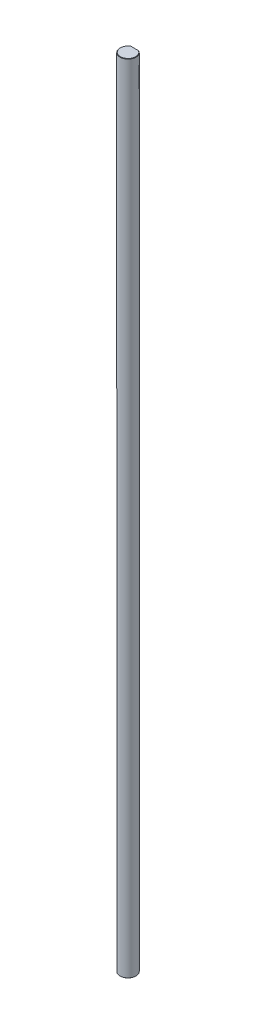
ISO-10303-21;
HEADER;
FILE_DESCRIPTION(('STEP AP214'),'2;1');
FILE_NAME('part.step','',(''),(''),'','','');
FILE_SCHEMA(('AUTOMOTIVE_DESIGN { 1 0 10303 214 1 1 1 1 }'));
ENDSEC;
DATA;
#1=APPLICATION_CONTEXT('core data for automotive mechanical design processes');
#2=APPLICATION_PROTOCOL_DEFINITION('international standard','automotive_design',2000,#1);
#3=PRODUCT_CONTEXT('',#1,'mechanical');
#4=PRODUCT('Part','Part','',(#3));
#5=PRODUCT_RELATED_PRODUCT_CATEGORY('part','',(#4));
#6=PRODUCT_DEFINITION_FORMATION('','',#4);
#7=PRODUCT_DEFINITION_CONTEXT('part definition',#1,'design');
#8=PRODUCT_DEFINITION('design','',#6,#7);
#9=PRODUCT_DEFINITION_SHAPE('','',#8);
#10=(LENGTH_UNIT() NAMED_UNIT(*) SI_UNIT(.MILLI.,.METRE.));
#11=(NAMED_UNIT(*) PLANE_ANGLE_UNIT() SI_UNIT($,.RADIAN.));
#12=(NAMED_UNIT(*) SI_UNIT($,.STERADIAN.) SOLID_ANGLE_UNIT());
#13=UNCERTAINTY_MEASURE_WITH_UNIT(LENGTH_MEASURE(1.E-05),#10,'distance_accuracy_value','');
#14=(GEOMETRIC_REPRESENTATION_CONTEXT(3) GLOBAL_UNCERTAINTY_ASSIGNED_CONTEXT((#13)) GLOBAL_UNIT_ASSIGNED_CONTEXT((#10,
#11,#12)) REPRESENTATION_CONTEXT('',''));
#15=CARTESIAN_POINT('',(0.,0.,0.));
#16=DIRECTION('',(0.,0.,1.));
#17=DIRECTION('',(1.,0.,0.));
#18=AXIS2_PLACEMENT_3D('',#15,#16,#17);
#19=CARTESIAN_POINT('',(0.,300.,0.));
#20=DIRECTION('',(0.,-1.,0.));
#21=DIRECTION('',(0.,0.,-1.));
#22=AXIS2_PLACEMENT_3D('',#19,#20,#21);
#23=CONICAL_SURFACE('',#22,2.875,0.78539816339744);
#24=CARTESIAN_POINT('',(-1.6583123951777,299.875,-2.5));
#25=CARTESIAN_POINT('',(-1.57973572193477,299.918434890403,-2.5));
#26=CARTESIAN_POINT('',(-1.50022900034243,299.960246696464,-2.5));
#27=CARTESIAN_POINT('',(-1.4197270864501,300.,-2.5));
#28=(BOUNDED_CURVE() B_SPLINE_CURVE(3,(#24,#25,#26,#27),.UNSPECIFIED.,.F.,
.F.) B_SPLINE_CURVE_WITH_KNOTS((4,4),(0.,0.000269347265701059),
.UNSPECIFIED.) CURVE() GEOMETRIC_REPRESENTATION_ITEM() RATIONAL_B_SPLINE_CURVE((1.,1.,1.,1.)) REPRESENTATION_ITEM(''));
#29=CARTESIAN_POINT('',(-1.6583123951777,299.875,-2.5));
#30=VERTEX_POINT('',#29);
#31=CARTESIAN_POINT('',(-1.4197270864501,300.,-2.5));
#32=VERTEX_POINT('',#31);
#33=EDGE_CURVE('E82',#30,#32,#28,.T.);
#34=ORIENTED_EDGE('',*,*,#33,.F.);
#35=CARTESIAN_POINT('',(0.,299.875,0.));
#36=DIRECTION('',(0.,-1.,0.));
#37=DIRECTION('',(0.,0.,1.));
#38=AXIS2_PLACEMENT_3D('',#35,#36,#37);
#39=CIRCLE('',#38,3.);
#40=CARTESIAN_POINT('',(1.6583123951777,299.875,-2.5));
#41=VERTEX_POINT('',#40);
#42=EDGE_CURVE('E104',#41,#30,#39,.T.);
#43=ORIENTED_EDGE('',*,*,#42,.F.);
#44=CARTESIAN_POINT('',(1.4197270864501,300.,-2.5));
#45=CARTESIAN_POINT('',(1.50022900034241,299.960246696464,-2.5));
#46=CARTESIAN_POINT('',(1.57973572193477,299.918434890403,-2.5));
#47=CARTESIAN_POINT('',(1.6583123951777,299.875,-2.5));
#48=(BOUNDED_CURVE() B_SPLINE_CURVE(3,(#44,#45,#46,#47),.UNSPECIFIED.,.F.,
.F.) B_SPLINE_CURVE_WITH_KNOTS((4,4),(0.,0.000269347265701066),
.UNSPECIFIED.) CURVE() GEOMETRIC_REPRESENTATION_ITEM() RATIONAL_B_SPLINE_CURVE((1.,1.,1.,1.)) REPRESENTATION_ITEM(''));
#49=CARTESIAN_POINT('',(1.4197270864501,300.,-2.5));
#50=VERTEX_POINT('',#49);
#51=EDGE_CURVE('E97',#50,#41,#48,.T.);
#52=ORIENTED_EDGE('',*,*,#51,.F.);
#53=CARTESIAN_POINT('',(0.,300.,0.));
#54=DIRECTION('',(0.,1.,0.));
#55=DIRECTION('',(0.,0.,1.));
#56=AXIS2_PLACEMENT_3D('',#53,#54,#55);
#57=CIRCLE('',#56,2.875);
#58=EDGE_CURVE('E25',#32,#50,#57,.T.);
#59=ORIENTED_EDGE('',*,*,#58,.F.);
#60=EDGE_LOOP('',(#34,#43,#52,#59));
#61=FACE_BOUND('',#60,.T.);
#62=ADVANCED_FACE('F15',(#61),#23,.T.);
#63=CARTESIAN_POINT('',(0.,0.124999999999931,0.));
#64=DIRECTION('',(0.,1.,0.));
#65=DIRECTION('',(0.,0.,1.));
#66=AXIS2_PLACEMENT_3D('',#63,#64,#65);
#67=CONICAL_SURFACE('',#66,3.,0.785398163397438);
#68=DIRECTION('',(0.,0.707106781186555,0.70710678118654));
#69=VECTOR('',#68,1.);
#70=CARTESIAN_POINT('',(0.,0.124999999999931,3.));
#71=LINE('',#70,#69);
#72=CARTESIAN_POINT('',(0.,0.,2.87500000000008));
#73=VERTEX_POINT('',#72);
#74=CARTESIAN_POINT('',(0.,0.124999999999931,3.));
#75=VERTEX_POINT('',#74);
#76=EDGE_CURVE('E147',#73,#75,#71,.T.);
#77=ORIENTED_EDGE('',*,*,#76,.F.);
#78=CARTESIAN_POINT('',(0.,0.,0.));
#79=DIRECTION('',(0.,-1.,0.));
#80=DIRECTION('',(0.,0.,1.));
#81=AXIS2_PLACEMENT_3D('',#78,#79,#80);
#82=CIRCLE('',#81,2.87500000000008);
#83=CARTESIAN_POINT('',(1.41972708645021,0.,-2.5));
#84=VERTEX_POINT('',#83);
#85=EDGE_CURVE('E10',#84,#73,#82,.T.);
#86=ORIENTED_EDGE('',*,*,#85,.F.);
#87=CARTESIAN_POINT('',(1.6583123951777,0.124999999999931,-2.5));
#88=CARTESIAN_POINT('',(1.5797357219348,0.0815651095964221,-2.5));
#89=CARTESIAN_POINT('',(1.50022900034249,0.0397533035352561,-2.5));
#90=CARTESIAN_POINT('',(1.41972708645021,0.,-2.5));
#91=(BOUNDED_CURVE() B_SPLINE_CURVE(3,(#87,#88,#89,#90),.UNSPECIFIED.,.F.,
.F.) B_SPLINE_CURVE_WITH_KNOTS((4,4),(0.,0.000269347265700939),
.UNSPECIFIED.) CURVE() GEOMETRIC_REPRESENTATION_ITEM() RATIONAL_B_SPLINE_CURVE((1.,1.,1.,1.)) REPRESENTATION_ITEM(''));
#92=CARTESIAN_POINT('',(1.6583123951777,0.124999999999931,-2.5));
#93=VERTEX_POINT('',#92);
#94=EDGE_CURVE('E106',#93,#84,#91,.T.);
#95=ORIENTED_EDGE('',*,*,#94,.F.);
#96=CARTESIAN_POINT('',(0.,0.124999999999931,0.));
#97=DIRECTION('',(0.,1.,0.));
#98=DIRECTION('',(0.,0.,1.));
#99=AXIS2_PLACEMENT_3D('',#96,#97,#98);
#100=CIRCLE('',#99,3.);
#101=EDGE_CURVE('E59',#75,#93,#100,.T.);
#102=ORIENTED_EDGE('',*,*,#101,.F.);
#103=EDGE_LOOP('',(#77,#86,#95,#102));
#104=FACE_BOUND('',#103,.T.);
#105=ADVANCED_FACE('F192',(#104),#67,.T.);
#106=CARTESIAN_POINT('',(0.,0.,0.));
#107=DIRECTION('',(0.,1.,0.));
#108=DIRECTION('',(1.,0.,0.));
#109=AXIS2_PLACEMENT_3D('',#106,#107,#108);
#110=PLANE('',#109);
#111=DIRECTION('',(1.,0.,0.));
#112=VECTOR('',#111,1.);
#113=CARTESIAN_POINT('',(0.,0.,-2.5));
#114=LINE('',#113,#112);
#115=CARTESIAN_POINT('',(-1.41972708645021,0.,-2.5));
#116=VERTEX_POINT('',#115);
#117=EDGE_CURVE('E18',#116,#84,#114,.T.);
#118=ORIENTED_EDGE('',*,*,#117,.T.);
#119=ORIENTED_EDGE('',*,*,#85,.T.);
#120=CARTESIAN_POINT('',(0.,0.,0.));
#121=DIRECTION('',(0.,-1.,0.));
#122=DIRECTION('',(0.,0.,1.));
#123=AXIS2_PLACEMENT_3D('',#120,#121,#122);
#124=CIRCLE('',#123,2.87500000000008);
#125=EDGE_CURVE('E169',#73,#116,#124,.T.);
#126=ORIENTED_EDGE('',*,*,#125,.T.);
#127=EDGE_LOOP('',(#118,#119,#126));
#128=FACE_BOUND('',#127,.T.);
#129=ADVANCED_FACE('F177',(#128),#110,.F.);
#130=CARTESIAN_POINT('',(0.,300.,0.));
#131=DIRECTION('',(0.,1.,0.));
#132=DIRECTION('',(1.,0.,0.));
#133=AXIS2_PLACEMENT_3D('',#130,#131,#132);
#134=PLANE('',#133);
#135=DIRECTION('',(1.,0.,0.));
#136=VECTOR('',#135,1.);
#137=CARTESIAN_POINT('',(0.,300.,-2.5));
#138=LINE('',#137,#136);
#139=EDGE_CURVE('E102',#32,#50,#138,.T.);
#140=ORIENTED_EDGE('',*,*,#139,.F.);
#141=ORIENTED_EDGE('',*,*,#58,.T.);
#142=EDGE_LOOP('',(#140,#141));
#143=FACE_BOUND('',#142,.T.);
#144=ADVANCED_FACE('F224',(#143),#134,.T.);
#145=CARTESIAN_POINT('',(0.,300.,-2.5));
#146=DIRECTION('',(0.,0.,-1.));
#147=DIRECTION('',(0.,-1.,0.));
#148=AXIS2_PLACEMENT_3D('',#145,#146,#147);
#149=PLANE('',#148);
#150=DIRECTION('',(0.,-1.,0.));
#151=VECTOR('',#150,1.);
#152=CARTESIAN_POINT('',(1.6583123951777,300.,-2.5));
#153=LINE('',#152,#151);
#154=EDGE_CURVE('E101',#41,#93,#153,.T.);
#155=ORIENTED_EDGE('',*,*,#154,.T.);
#156=ORIENTED_EDGE('',*,*,#94,.T.);
#157=ORIENTED_EDGE('',*,*,#117,.F.);
#158=CARTESIAN_POINT('',(-1.41972708645021,0.,-2.5));
#159=CARTESIAN_POINT('',(-1.50022900034248,0.0397533035352803,-2.5));
#160=CARTESIAN_POINT('',(-1.57973572193481,0.0815651095964097,-2.5));
#161=CARTESIAN_POINT('',(-1.6583123951777,0.124999999999931,-2.5));
#162=(BOUNDED_CURVE() B_SPLINE_CURVE(3,(#158,#159,#160,#161),.UNSPECIFIED.,.F.,
.F.) B_SPLINE_CURVE_WITH_KNOTS((4,4),(0.,0.000269347265700938),
.UNSPECIFIED.) CURVE() GEOMETRIC_REPRESENTATION_ITEM() RATIONAL_B_SPLINE_CURVE((1.,1.,1.,1.)) REPRESENTATION_ITEM(''));
#163=CARTESIAN_POINT('',(-1.6583123951777,0.124999999999931,-2.5));
#164=VERTEX_POINT('',#163);
#165=EDGE_CURVE('E149',#116,#164,#162,.T.);
#166=ORIENTED_EDGE('',*,*,#165,.T.);
#167=DIRECTION('',(0.,-1.,0.));
#168=VECTOR('',#167,1.);
#169=CARTESIAN_POINT('',(-1.6583123951777,300.,-2.5));
#170=LINE('',#169,#168);
#171=EDGE_CURVE('E69',#30,#164,#170,.T.);
#172=ORIENTED_EDGE('',*,*,#171,.F.);
#173=ORIENTED_EDGE('',*,*,#33,.T.);
#174=ORIENTED_EDGE('',*,*,#139,.T.);
#175=ORIENTED_EDGE('',*,*,#51,.T.);
#176=EDGE_LOOP('',(#155,#156,#157,#166,#172,#173,#174,#175));
#177=FACE_BOUND('',#176,.T.);
#178=ADVANCED_FACE('F98',(#177),#149,.T.);
#179=CARTESIAN_POINT('',(0.,300.,0.));
#180=DIRECTION('',(0.,-1.,0.));
#181=DIRECTION('',(0.,0.,-1.));
#182=AXIS2_PLACEMENT_3D('',#179,#180,#181);
#183=CYLINDRICAL_SURFACE('',#182,3.);
#184=ORIENTED_EDGE('',*,*,#171,.T.);
#185=CARTESIAN_POINT('',(0.,0.124999999999931,0.));
#186=DIRECTION('',(0.,1.,0.));
#187=DIRECTION('',(0.,0.,1.));
#188=AXIS2_PLACEMENT_3D('',#185,#186,#187);
#189=CIRCLE('',#188,3.);
#190=EDGE_CURVE('E156',#164,#75,#189,.T.);
#191=ORIENTED_EDGE('',*,*,#190,.T.);
#192=ORIENTED_EDGE('',*,*,#101,.T.);
#193=ORIENTED_EDGE('',*,*,#154,.F.);
#194=ORIENTED_EDGE('',*,*,#42,.T.);
#195=EDGE_LOOP('',(#184,#191,#192,#193,#194));
#196=FACE_BOUND('',#195,.T.);
#197=ADVANCED_FACE('F108',(#196),#183,.T.);
#198=CARTESIAN_POINT('',(0.,0.124999999999931,0.));
#199=DIRECTION('',(0.,1.,0.));
#200=DIRECTION('',(0.,0.,1.));
#201=AXIS2_PLACEMENT_3D('',#198,#199,#200);
#202=CONICAL_SURFACE('',#201,3.,0.785398163397438);
#203=ORIENTED_EDGE('',*,*,#125,.F.);
#204=ORIENTED_EDGE('',*,*,#76,.T.);
#205=ORIENTED_EDGE('',*,*,#190,.F.);
#206=ORIENTED_EDGE('',*,*,#165,.F.);
#207=EDGE_LOOP('',(#203,#204,#205,#206));
#208=FACE_BOUND('',#207,.T.);
#209=ADVANCED_FACE('F179',(#208),#202,.T.);
#210=CLOSED_SHELL('',(#62,#105,#129,#144,#178,#197,#209));
#211=MANIFOLD_SOLID_BREP('B1',#210);
#212=ADVANCED_BREP_SHAPE_REPRESENTATION('',(#18,#211),#14);
#213=SHAPE_DEFINITION_REPRESENTATION(#9,#212);
ENDSEC;
END-ISO-10303-21;
